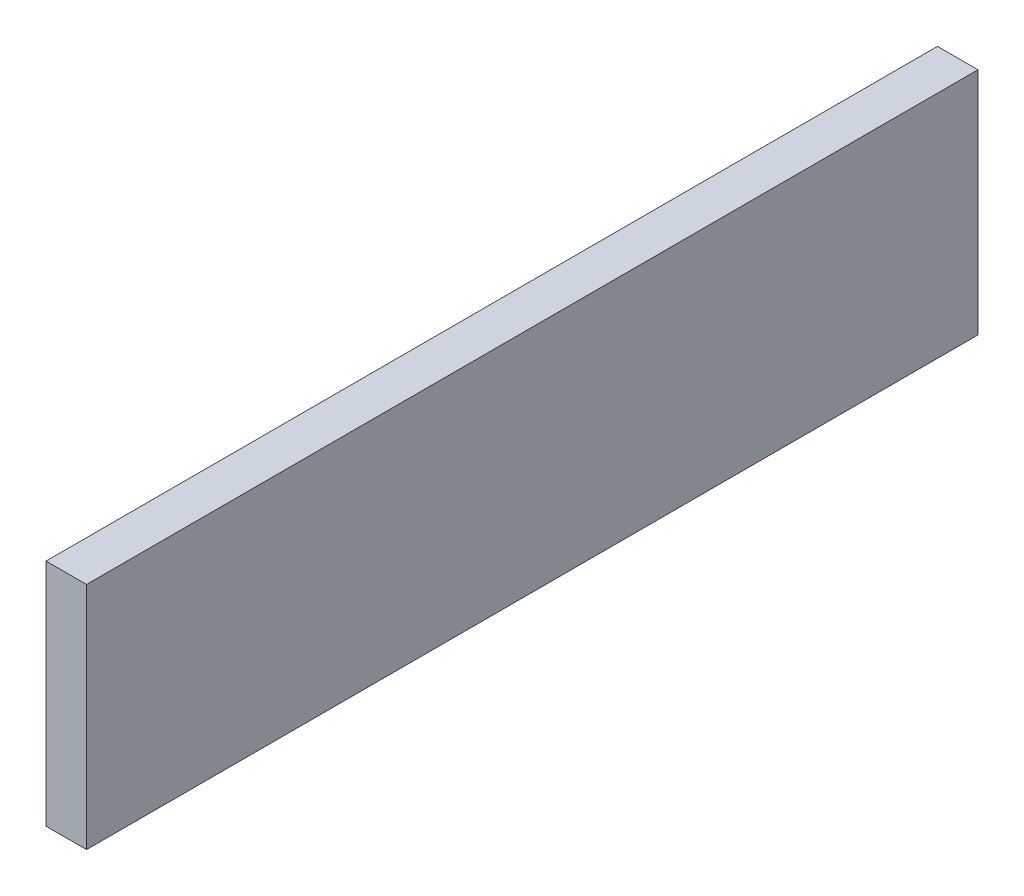
ISO-10303-21;
HEADER;
FILE_DESCRIPTION(('STEP AP214'),'2;1');
FILE_NAME('part.step','',(''),(''),'','','');
FILE_SCHEMA(('AUTOMOTIVE_DESIGN { 1 0 10303 214 1 1 1 1 }'));
ENDSEC;
DATA;
#1=APPLICATION_CONTEXT('core data for automotive mechanical design processes');
#2=APPLICATION_PROTOCOL_DEFINITION('international standard','automotive_design',2000,#1);
#3=PRODUCT_CONTEXT('',#1,'mechanical');
#4=PRODUCT('Part','Part','',(#3));
#5=PRODUCT_RELATED_PRODUCT_CATEGORY('part','',(#4));
#6=PRODUCT_DEFINITION_FORMATION('','',#4);
#7=PRODUCT_DEFINITION_CONTEXT('part definition',#1,'design');
#8=PRODUCT_DEFINITION('design','',#6,#7);
#9=PRODUCT_DEFINITION_SHAPE('','',#8);
#10=(LENGTH_UNIT() NAMED_UNIT(*) SI_UNIT(.MILLI.,.METRE.));
#11=(NAMED_UNIT(*) PLANE_ANGLE_UNIT() SI_UNIT($,.RADIAN.));
#12=(NAMED_UNIT(*) SI_UNIT($,.STERADIAN.) SOLID_ANGLE_UNIT());
#13=UNCERTAINTY_MEASURE_WITH_UNIT(LENGTH_MEASURE(1.E-05),#10,'distance_accuracy_value','');
#14=(GEOMETRIC_REPRESENTATION_CONTEXT(3) GLOBAL_UNCERTAINTY_ASSIGNED_CONTEXT((#13)) GLOBAL_UNIT_ASSIGNED_CONTEXT((#10,
#11,#12)) REPRESENTATION_CONTEXT('',''));
#15=CARTESIAN_POINT('',(0.,0.,0.));
#16=DIRECTION('',(0.,0.,1.));
#17=DIRECTION('',(1.,0.,0.));
#18=AXIS2_PLACEMENT_3D('',#15,#16,#17);
#19=CARTESIAN_POINT('',(19.05,107.95,0.));
#20=DIRECTION('',(0.,0.,-1.));
#21=DIRECTION('',(0.,1.,0.));
#22=AXIS2_PLACEMENT_3D('',#19,#20,#21);
#23=PLANE('',#22);
#24=DIRECTION('',(0.,-1.,0.));
#25=VECTOR('',#24,1.);
#26=CARTESIAN_POINT('',(0.,107.95,0.));
#27=LINE('',#26,#25);
#28=CARTESIAN_POINT('',(0.,107.95,0.));
#29=VERTEX_POINT('',#28);
#30=CARTESIAN_POINT('',(0.,0.,0.));
#31=VERTEX_POINT('',#30);
#32=EDGE_CURVE('E96',#29,#31,#27,.T.);
#33=ORIENTED_EDGE('',*,*,#32,.T.);
#34=DIRECTION('',(-1.,0.,0.));
#35=VECTOR('',#34,1.);
#36=CARTESIAN_POINT('',(19.05,0.,0.));
#37=LINE('',#36,#35);
#38=CARTESIAN_POINT('',(19.05,0.,0.));
#39=VERTEX_POINT('',#38);
#40=EDGE_CURVE('E11',#39,#31,#37,.T.);
#41=ORIENTED_EDGE('',*,*,#40,.F.);
#42=DIRECTION('',(0.,-1.,0.));
#43=VECTOR('',#42,1.);
#44=CARTESIAN_POINT('',(19.05,107.95,0.));
#45=LINE('',#44,#43);
#46=CARTESIAN_POINT('',(19.05,107.95,0.));
#47=VERTEX_POINT('',#46);
#48=EDGE_CURVE('E84',#47,#39,#45,.T.);
#49=ORIENTED_EDGE('',*,*,#48,.F.);
#50=DIRECTION('',(-1.,0.,0.));
#51=VECTOR('',#50,1.);
#52=CARTESIAN_POINT('',(19.05,107.95,0.));
#53=LINE('',#52,#51);
#54=EDGE_CURVE('E92',#47,#29,#53,.T.);
#55=ORIENTED_EDGE('',*,*,#54,.T.);
#56=EDGE_LOOP('',(#33,#41,#49,#55));
#57=FACE_BOUND('',#56,.T.);
#58=ADVANCED_FACE('F33',(#57),#23,.F.);
#59=CARTESIAN_POINT('',(19.05,0.,0.));
#60=DIRECTION('',(0.,1.,0.));
#61=DIRECTION('',(0.,0.,1.));
#62=AXIS2_PLACEMENT_3D('',#59,#60,#61);
#63=PLANE('',#62);
#64=DIRECTION('',(0.,0.,-1.));
#65=VECTOR('',#64,1.);
#66=CARTESIAN_POINT('',(0.,0.,0.));
#67=LINE('',#66,#65);
#68=CARTESIAN_POINT('',(0.,0.,-419.1));
#69=VERTEX_POINT('',#68);
#70=EDGE_CURVE('E88',#31,#69,#67,.T.);
#71=ORIENTED_EDGE('',*,*,#70,.T.);
#72=DIRECTION('',(-1.,0.,0.));
#73=VECTOR('',#72,1.);
#74=CARTESIAN_POINT('',(19.05,0.,-419.1));
#75=LINE('',#74,#73);
#76=CARTESIAN_POINT('',(19.05,0.,-419.1));
#77=VERTEX_POINT('',#76);
#78=EDGE_CURVE('E41',#77,#69,#75,.T.);
#79=ORIENTED_EDGE('',*,*,#78,.F.);
#80=DIRECTION('',(0.,0.,-1.));
#81=VECTOR('',#80,1.);
#82=CARTESIAN_POINT('',(19.05,0.,0.));
#83=LINE('',#82,#81);
#84=EDGE_CURVE('E79',#39,#77,#83,.T.);
#85=ORIENTED_EDGE('',*,*,#84,.F.);
#86=ORIENTED_EDGE('',*,*,#40,.T.);
#87=EDGE_LOOP('',(#71,#79,#85,#86));
#88=FACE_BOUND('',#87,.T.);
#89=ADVANCED_FACE('F87',(#88),#63,.F.);
#90=CARTESIAN_POINT('',(19.05,107.95,-419.1));
#91=DIRECTION('',(0.,0.,1.));
#92=DIRECTION('',(0.,-1.,0.));
#93=AXIS2_PLACEMENT_3D('',#90,#91,#92);
#94=PLANE('',#93);
#95=DIRECTION('',(0.,1.,0.));
#96=VECTOR('',#95,1.);
#97=CARTESIAN_POINT('',(0.,107.95,-419.1));
#98=LINE('',#97,#96);
#99=CARTESIAN_POINT('',(0.,107.95,-419.1));
#100=VERTEX_POINT('',#99);
#101=EDGE_CURVE('E66',#69,#100,#98,.T.);
#102=ORIENTED_EDGE('',*,*,#101,.T.);
#103=DIRECTION('',(-1.,0.,0.));
#104=VECTOR('',#103,1.);
#105=CARTESIAN_POINT('',(19.05,107.95,-419.1));
#106=LINE('',#105,#104);
#107=CARTESIAN_POINT('',(19.05,107.95,-419.1));
#108=VERTEX_POINT('',#107);
#109=EDGE_CURVE('E89',#108,#100,#106,.T.);
#110=ORIENTED_EDGE('',*,*,#109,.F.);
#111=DIRECTION('',(0.,1.,0.));
#112=VECTOR('',#111,1.);
#113=CARTESIAN_POINT('',(19.05,107.95,-419.1));
#114=LINE('',#113,#112);
#115=EDGE_CURVE('E82',#77,#108,#114,.T.);
#116=ORIENTED_EDGE('',*,*,#115,.F.);
#117=ORIENTED_EDGE('',*,*,#78,.T.);
#118=EDGE_LOOP('',(#102,#110,#116,#117));
#119=FACE_BOUND('',#118,.T.);
#120=ADVANCED_FACE('F90',(#119),#94,.F.);
#121=CARTESIAN_POINT('',(19.05,107.95,0.));
#122=DIRECTION('',(0.,-1.,0.));
#123=DIRECTION('',(0.,0.,-1.));
#124=AXIS2_PLACEMENT_3D('',#121,#122,#123);
#125=PLANE('',#124);
#126=DIRECTION('',(0.,0.,1.));
#127=VECTOR('',#126,1.);
#128=CARTESIAN_POINT('',(0.,107.95,0.));
#129=LINE('',#128,#127);
#130=EDGE_CURVE('E72',#100,#29,#129,.T.);
#131=ORIENTED_EDGE('',*,*,#130,.T.);
#132=ORIENTED_EDGE('',*,*,#54,.F.);
#133=DIRECTION('',(0.,0.,1.));
#134=VECTOR('',#133,1.);
#135=CARTESIAN_POINT('',(19.05,107.95,0.));
#136=LINE('',#135,#134);
#137=EDGE_CURVE('E49',#108,#47,#136,.T.);
#138=ORIENTED_EDGE('',*,*,#137,.F.);
#139=ORIENTED_EDGE('',*,*,#109,.T.);
#140=EDGE_LOOP('',(#131,#132,#138,#139));
#141=FACE_BOUND('',#140,.T.);
#142=ADVANCED_FACE('F103',(#141),#125,.F.);
#143=CARTESIAN_POINT('',(19.05,0.,0.));
#144=DIRECTION('',(1.,0.,0.));
#145=DIRECTION('',(0.,0.,-1.));
#146=AXIS2_PLACEMENT_3D('',#143,#144,#145);
#147=PLANE('',#146);
#148=ORIENTED_EDGE('',*,*,#48,.T.);
#149=ORIENTED_EDGE('',*,*,#84,.T.);
#150=ORIENTED_EDGE('',*,*,#115,.T.);
#151=ORIENTED_EDGE('',*,*,#137,.T.);
#152=EDGE_LOOP('',(#148,#149,#150,#151));
#153=FACE_BOUND('',#152,.T.);
#154=ADVANCED_FACE('F80',(#153),#147,.T.);
#155=CARTESIAN_POINT('',(0.,0.,0.));
#156=DIRECTION('',(1.,0.,0.));
#157=DIRECTION('',(0.,0.,-1.));
#158=AXIS2_PLACEMENT_3D('',#155,#156,#157);
#159=PLANE('',#158);
#160=ORIENTED_EDGE('',*,*,#32,.F.);
#161=ORIENTED_EDGE('',*,*,#130,.F.);
#162=ORIENTED_EDGE('',*,*,#101,.F.);
#163=ORIENTED_EDGE('',*,*,#70,.F.);
#164=EDGE_LOOP('',(#160,#161,#162,#163));
#165=FACE_BOUND('',#164,.T.);
#166=ADVANCED_FACE('F106',(#165),#159,.F.);
#167=CLOSED_SHELL('',(#58,#89,#120,#142,#154,#166));
#168=MANIFOLD_SOLID_BREP('B2',#167);
#169=ADVANCED_BREP_SHAPE_REPRESENTATION('',(#18,#168),#14);
#170=SHAPE_DEFINITION_REPRESENTATION(#9,#169);
ENDSEC;
END-ISO-10303-21;
